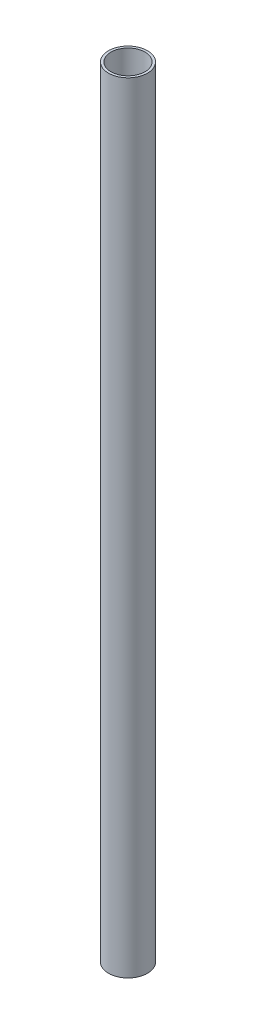
ISO-10303-21;
HEADER;
FILE_DESCRIPTION(('STEP AP214'),'2;1');
FILE_NAME('part.step','',(''),(''),'','','');
FILE_SCHEMA(('AUTOMOTIVE_DESIGN { 1 0 10303 214 1 1 1 1 }'));
ENDSEC;
DATA;
#1=APPLICATION_CONTEXT('core data for automotive mechanical design processes');
#2=APPLICATION_PROTOCOL_DEFINITION('international standard','automotive_design',2000,#1);
#3=PRODUCT_CONTEXT('',#1,'mechanical');
#4=PRODUCT('Part','Part','',(#3));
#5=PRODUCT_RELATED_PRODUCT_CATEGORY('part','',(#4));
#6=PRODUCT_DEFINITION_FORMATION('','',#4);
#7=PRODUCT_DEFINITION_CONTEXT('part definition',#1,'design');
#8=PRODUCT_DEFINITION('design','',#6,#7);
#9=PRODUCT_DEFINITION_SHAPE('','',#8);
#10=(LENGTH_UNIT() NAMED_UNIT(*) SI_UNIT(.MILLI.,.METRE.));
#11=(NAMED_UNIT(*) PLANE_ANGLE_UNIT() SI_UNIT($,.RADIAN.));
#12=(NAMED_UNIT(*) SI_UNIT($,.STERADIAN.) SOLID_ANGLE_UNIT());
#13=UNCERTAINTY_MEASURE_WITH_UNIT(LENGTH_MEASURE(1.E-05),#10,'distance_accuracy_value','');
#14=(GEOMETRIC_REPRESENTATION_CONTEXT(3) GLOBAL_UNCERTAINTY_ASSIGNED_CONTEXT((#13)) GLOBAL_UNIT_ASSIGNED_CONTEXT((#10,
#11,#12)) REPRESENTATION_CONTEXT('',''));
#15=CARTESIAN_POINT('',(0.,0.,0.));
#16=DIRECTION('',(0.,0.,1.));
#17=DIRECTION('',(1.,0.,0.));
#18=AXIS2_PLACEMENT_3D('',#15,#16,#17);
#19=CARTESIAN_POINT('',(0.,2032.,0.));
#20=DIRECTION('',(0.,1.,0.));
#21=DIRECTION('',(0.,0.,1.));
#22=AXIS2_PLACEMENT_3D('',#19,#20,#21);
#23=PLANE('',#22);
#24=CARTESIAN_POINT('',(0.,2032.,0.));
#25=DIRECTION('',(0.,1.,0.));
#26=DIRECTION('',(0.,0.,1.));
#27=AXIS2_PLACEMENT_3D('',#24,#25,#26);
#28=CIRCLE('',#27,50.8);
#29=CARTESIAN_POINT('',(0.,2032.,50.8));
#30=VERTEX_POINT('',#29);
#31=EDGE_CURVE('E10',#30,#30,#28,.T.);
#32=ORIENTED_EDGE('',*,*,#31,.T.);
#33=EDGE_LOOP('',(#32));
#34=FACE_BOUND('',#33,.T.);
#35=CARTESIAN_POINT('',(0.,2032.,0.));
#36=DIRECTION('',(0.,1.,0.));
#37=DIRECTION('',(0.,0.,1.));
#38=AXIS2_PLACEMENT_3D('',#35,#36,#37);
#39=CIRCLE('',#38,44.45);
#40=CARTESIAN_POINT('',(0.,2032.,44.45));
#41=VERTEX_POINT('',#40);
#42=EDGE_CURVE('E47',#41,#41,#39,.T.);
#43=ORIENTED_EDGE('',*,*,#42,.F.);
#44=EDGE_LOOP('',(#43));
#45=FACE_BOUND('',#44,.T.);
#46=ADVANCED_FACE('F33',(#34,#45),#23,.T.);
#47=CARTESIAN_POINT('',(0.,0.,0.));
#48=DIRECTION('',(0.,1.,0.));
#49=DIRECTION('',(0.,0.,1.));
#50=AXIS2_PLACEMENT_3D('',#47,#48,#49);
#51=PLANE('',#50);
#52=CARTESIAN_POINT('',(0.,0.,0.));
#53=DIRECTION('',(0.,1.,0.));
#54=DIRECTION('',(0.,0.,1.));
#55=AXIS2_PLACEMENT_3D('',#52,#53,#54);
#56=CIRCLE('',#55,50.8);
#57=CARTESIAN_POINT('',(0.,0.,50.8));
#58=VERTEX_POINT('',#57);
#59=EDGE_CURVE('E37',#58,#58,#56,.T.);
#60=ORIENTED_EDGE('',*,*,#59,.F.);
#61=EDGE_LOOP('',(#60));
#62=FACE_BOUND('',#61,.T.);
#63=CARTESIAN_POINT('',(0.,0.,0.));
#64=DIRECTION('',(0.,1.,0.));
#65=DIRECTION('',(0.,0.,1.));
#66=AXIS2_PLACEMENT_3D('',#63,#64,#65);
#67=CIRCLE('',#66,44.45);
#68=CARTESIAN_POINT('',(0.,0.,44.45));
#69=VERTEX_POINT('',#68);
#70=EDGE_CURVE('E49',#69,#69,#67,.T.);
#71=ORIENTED_EDGE('',*,*,#70,.T.);
#72=EDGE_LOOP('',(#71));
#73=FACE_BOUND('',#72,.T.);
#74=ADVANCED_FACE('F62',(#62,#73),#51,.F.);
#75=CARTESIAN_POINT('',(0.,2032.,0.));
#76=DIRECTION('',(0.,-1.,0.));
#77=DIRECTION('',(0.,0.,-1.));
#78=AXIS2_PLACEMENT_3D('',#75,#76,#77);
#79=CYLINDRICAL_SURFACE('',#78,50.8);
#80=ORIENTED_EDGE('',*,*,#31,.F.);
#81=EDGE_LOOP('',(#80));
#82=FACE_BOUND('',#81,.T.);
#83=ORIENTED_EDGE('',*,*,#59,.T.);
#84=EDGE_LOOP('',(#83));
#85=FACE_BOUND('',#84,.T.);
#86=ADVANCED_FACE('F35',(#82,#85),#79,.T.);
#87=CARTESIAN_POINT('',(0.,2032.,0.));
#88=DIRECTION('',(0.,-1.,0.));
#89=DIRECTION('',(0.,0.,-1.));
#90=AXIS2_PLACEMENT_3D('',#87,#88,#89);
#91=CYLINDRICAL_SURFACE('',#90,44.45);
#92=ORIENTED_EDGE('',*,*,#42,.T.);
#93=EDGE_LOOP('',(#92));
#94=FACE_BOUND('',#93,.T.);
#95=ORIENTED_EDGE('',*,*,#70,.F.);
#96=EDGE_LOOP('',(#95));
#97=FACE_BOUND('',#96,.T.);
#98=ADVANCED_FACE('F58',(#94,#97),#91,.F.);
#99=CLOSED_SHELL('',(#46,#74,#86,#98));
#100=MANIFOLD_SOLID_BREP('B2',#99);
#101=ADVANCED_BREP_SHAPE_REPRESENTATION('',(#18,#100),#14);
#102=SHAPE_DEFINITION_REPRESENTATION(#9,#101);
ENDSEC;
END-ISO-10303-21;
